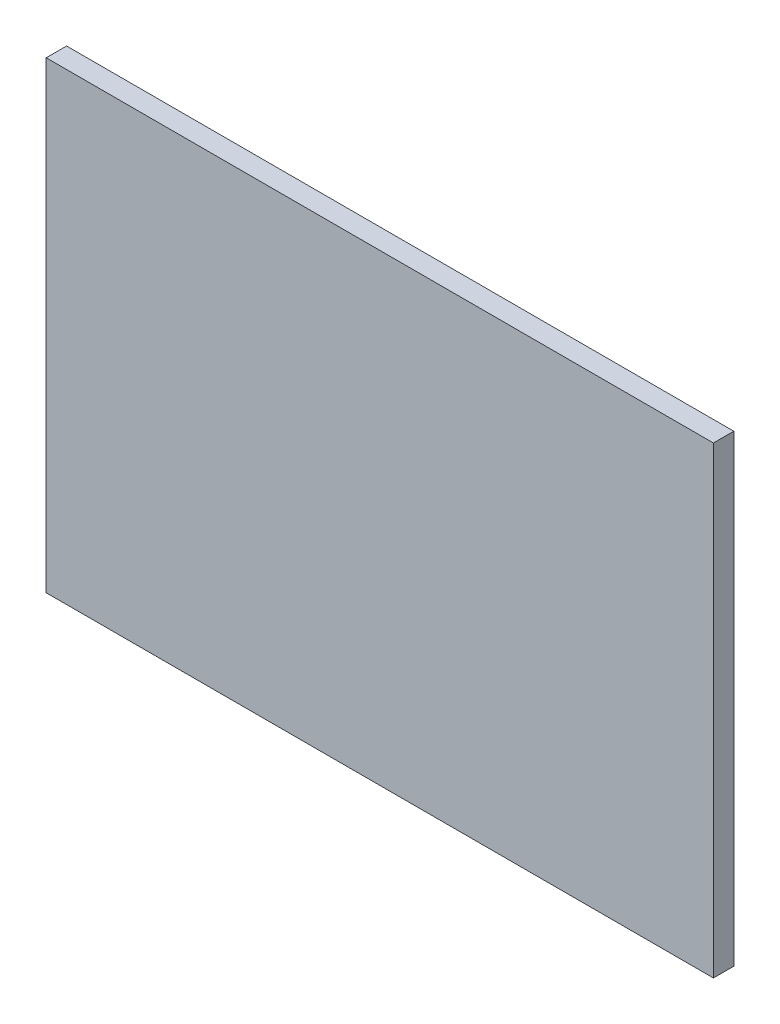
ISO-10303-21;
HEADER;
FILE_DESCRIPTION(('STEP AP214'),'2;1');
FILE_NAME('part.step','',(''),(''),'','','');
FILE_SCHEMA(('AUTOMOTIVE_DESIGN { 1 0 10303 214 1 1 1 1 }'));
ENDSEC;
DATA;
#1=APPLICATION_CONTEXT('core data for automotive mechanical design processes');
#2=APPLICATION_PROTOCOL_DEFINITION('international standard','automotive_design',2000,#1);
#3=PRODUCT_CONTEXT('',#1,'mechanical');
#4=PRODUCT('Part','Part','',(#3));
#5=PRODUCT_RELATED_PRODUCT_CATEGORY('part','',(#4));
#6=PRODUCT_DEFINITION_FORMATION('','',#4);
#7=PRODUCT_DEFINITION_CONTEXT('part definition',#1,'design');
#8=PRODUCT_DEFINITION('design','',#6,#7);
#9=PRODUCT_DEFINITION_SHAPE('','',#8);
#10=(LENGTH_UNIT() NAMED_UNIT(*) SI_UNIT(.MILLI.,.METRE.));
#11=(NAMED_UNIT(*) PLANE_ANGLE_UNIT() SI_UNIT($,.RADIAN.));
#12=(NAMED_UNIT(*) SI_UNIT($,.STERADIAN.) SOLID_ANGLE_UNIT());
#13=UNCERTAINTY_MEASURE_WITH_UNIT(LENGTH_MEASURE(1.E-05),#10,'distance_accuracy_value','');
#14=(GEOMETRIC_REPRESENTATION_CONTEXT(3) GLOBAL_UNCERTAINTY_ASSIGNED_CONTEXT((#13)) GLOBAL_UNIT_ASSIGNED_CONTEXT((#10,
#11,#12)) REPRESENTATION_CONTEXT('',''));
#15=CARTESIAN_POINT('',(0.,0.,0.));
#16=DIRECTION('',(0.,0.,1.));
#17=DIRECTION('',(1.,0.,0.));
#18=AXIS2_PLACEMENT_3D('',#15,#16,#17);
#19=CARTESIAN_POINT('',(18.,-12.5,1.1));
#20=DIRECTION('',(-1.,0.,0.));
#21=DIRECTION('',(0.,0.,1.));
#22=AXIS2_PLACEMENT_3D('',#19,#20,#21);
#23=PLANE('',#22);
#24=DIRECTION('',(0.,1.,0.));
#25=VECTOR('',#24,1.);
#26=CARTESIAN_POINT('',(18.,-12.5,0.));
#27=LINE('',#26,#25);
#28=CARTESIAN_POINT('',(18.,-12.5,0.));
#29=VERTEX_POINT('',#28);
#30=CARTESIAN_POINT('',(18.,12.5,0.));
#31=VERTEX_POINT('',#30);
#32=EDGE_CURVE('E98',#29,#31,#27,.T.);
#33=ORIENTED_EDGE('',*,*,#32,.T.);
#34=DIRECTION('',(0.,0.,-1.));
#35=VECTOR('',#34,1.);
#36=CARTESIAN_POINT('',(18.,12.5,1.1));
#37=LINE('',#36,#35);
#38=CARTESIAN_POINT('',(18.,12.5,1.1));
#39=VERTEX_POINT('',#38);
#40=EDGE_CURVE('E11',#39,#31,#37,.T.);
#41=ORIENTED_EDGE('',*,*,#40,.F.);
#42=DIRECTION('',(0.,1.,0.));
#43=VECTOR('',#42,1.);
#44=CARTESIAN_POINT('',(18.,-12.5,1.1));
#45=LINE('',#44,#43);
#46=CARTESIAN_POINT('',(18.,-12.5,1.1));
#47=VERTEX_POINT('',#46);
#48=EDGE_CURVE('E86',#47,#39,#45,.T.);
#49=ORIENTED_EDGE('',*,*,#48,.F.);
#50=DIRECTION('',(0.,0.,-1.));
#51=VECTOR('',#50,1.);
#52=CARTESIAN_POINT('',(18.,-12.5,1.1));
#53=LINE('',#52,#51);
#54=EDGE_CURVE('E94',#47,#29,#53,.T.);
#55=ORIENTED_EDGE('',*,*,#54,.T.);
#56=EDGE_LOOP('',(#33,#41,#49,#55));
#57=FACE_BOUND('',#56,.T.);
#58=ADVANCED_FACE('F35',(#57),#23,.F.);
#59=CARTESIAN_POINT('',(-18.,12.5,1.1));
#60=DIRECTION('',(0.,-1.,0.));
#61=DIRECTION('',(0.,0.,-1.));
#62=AXIS2_PLACEMENT_3D('',#59,#60,#61);
#63=PLANE('',#62);
#64=DIRECTION('',(-1.,0.,0.));
#65=VECTOR('',#64,1.);
#66=CARTESIAN_POINT('',(-18.,12.5,0.));
#67=LINE('',#66,#65);
#68=CARTESIAN_POINT('',(-18.,12.5,0.));
#69=VERTEX_POINT('',#68);
#70=EDGE_CURVE('E90',#31,#69,#67,.T.);
#71=ORIENTED_EDGE('',*,*,#70,.T.);
#72=DIRECTION('',(0.,0.,-1.));
#73=VECTOR('',#72,1.);
#74=CARTESIAN_POINT('',(-18.,12.5,1.1));
#75=LINE('',#74,#73);
#76=CARTESIAN_POINT('',(-18.,12.5,1.1));
#77=VERTEX_POINT('',#76);
#78=EDGE_CURVE('E43',#77,#69,#75,.T.);
#79=ORIENTED_EDGE('',*,*,#78,.F.);
#80=DIRECTION('',(-1.,0.,0.));
#81=VECTOR('',#80,1.);
#82=CARTESIAN_POINT('',(-18.,12.5,1.1));
#83=LINE('',#82,#81);
#84=EDGE_CURVE('E81',#39,#77,#83,.T.);
#85=ORIENTED_EDGE('',*,*,#84,.F.);
#86=ORIENTED_EDGE('',*,*,#40,.T.);
#87=EDGE_LOOP('',(#71,#79,#85,#86));
#88=FACE_BOUND('',#87,.T.);
#89=ADVANCED_FACE('F89',(#88),#63,.F.);
#90=CARTESIAN_POINT('',(-18.,-12.5,1.1));
#91=DIRECTION('',(1.,0.,0.));
#92=DIRECTION('',(0.,0.,-1.));
#93=AXIS2_PLACEMENT_3D('',#90,#91,#92);
#94=PLANE('',#93);
#95=DIRECTION('',(0.,-1.,0.));
#96=VECTOR('',#95,1.);
#97=CARTESIAN_POINT('',(-18.,-12.5,0.));
#98=LINE('',#97,#96);
#99=CARTESIAN_POINT('',(-18.,-12.5,0.));
#100=VERTEX_POINT('',#99);
#101=EDGE_CURVE('E68',#69,#100,#98,.T.);
#102=ORIENTED_EDGE('',*,*,#101,.T.);
#103=DIRECTION('',(0.,0.,-1.));
#104=VECTOR('',#103,1.);
#105=CARTESIAN_POINT('',(-18.,-12.5,1.1));
#106=LINE('',#105,#104);
#107=CARTESIAN_POINT('',(-18.,-12.5,1.1));
#108=VERTEX_POINT('',#107);
#109=EDGE_CURVE('E91',#108,#100,#106,.T.);
#110=ORIENTED_EDGE('',*,*,#109,.F.);
#111=DIRECTION('',(0.,-1.,0.));
#112=VECTOR('',#111,1.);
#113=CARTESIAN_POINT('',(-18.,-12.5,1.1));
#114=LINE('',#113,#112);
#115=EDGE_CURVE('E84',#77,#108,#114,.T.);
#116=ORIENTED_EDGE('',*,*,#115,.F.);
#117=ORIENTED_EDGE('',*,*,#78,.T.);
#118=EDGE_LOOP('',(#102,#110,#116,#117));
#119=FACE_BOUND('',#118,.T.);
#120=ADVANCED_FACE('F92',(#119),#94,.F.);
#121=CARTESIAN_POINT('',(-18.,-12.5,1.1));
#122=DIRECTION('',(0.,1.,0.));
#123=DIRECTION('',(0.,0.,1.));
#124=AXIS2_PLACEMENT_3D('',#121,#122,#123);
#125=PLANE('',#124);
#126=DIRECTION('',(1.,0.,0.));
#127=VECTOR('',#126,1.);
#128=CARTESIAN_POINT('',(-18.,-12.5,0.));
#129=LINE('',#128,#127);
#130=EDGE_CURVE('E74',#100,#29,#129,.T.);
#131=ORIENTED_EDGE('',*,*,#130,.T.);
#132=ORIENTED_EDGE('',*,*,#54,.F.);
#133=DIRECTION('',(1.,0.,0.));
#134=VECTOR('',#133,1.);
#135=CARTESIAN_POINT('',(-18.,-12.5,1.1));
#136=LINE('',#135,#134);
#137=EDGE_CURVE('E51',#108,#47,#136,.T.);
#138=ORIENTED_EDGE('',*,*,#137,.F.);
#139=ORIENTED_EDGE('',*,*,#109,.T.);
#140=EDGE_LOOP('',(#131,#132,#138,#139));
#141=FACE_BOUND('',#140,.T.);
#142=ADVANCED_FACE('F105',(#141),#125,.F.);
#143=CARTESIAN_POINT('',(0.,0.,1.1));
#144=DIRECTION('',(0.,0.,-1.));
#145=DIRECTION('',(-1.,0.,0.));
#146=AXIS2_PLACEMENT_3D('',#143,#144,#145);
#147=PLANE('',#146);
#148=ORIENTED_EDGE('',*,*,#48,.T.);
#149=ORIENTED_EDGE('',*,*,#84,.T.);
#150=ORIENTED_EDGE('',*,*,#115,.T.);
#151=ORIENTED_EDGE('',*,*,#137,.T.);
#152=EDGE_LOOP('',(#148,#149,#150,#151));
#153=FACE_BOUND('',#152,.T.);
#154=ADVANCED_FACE('F82',(#153),#147,.F.);
#155=CARTESIAN_POINT('',(0.,0.,0.));
#156=DIRECTION('',(0.,0.,-1.));
#157=DIRECTION('',(-1.,0.,0.));
#158=AXIS2_PLACEMENT_3D('',#155,#156,#157);
#159=PLANE('',#158);
#160=ORIENTED_EDGE('',*,*,#32,.F.);
#161=ORIENTED_EDGE('',*,*,#130,.F.);
#162=ORIENTED_EDGE('',*,*,#101,.F.);
#163=ORIENTED_EDGE('',*,*,#70,.F.);
#164=EDGE_LOOP('',(#160,#161,#162,#163));
#165=FACE_BOUND('',#164,.T.);
#166=ADVANCED_FACE('F108',(#165),#159,.T.);
#167=CLOSED_SHELL('',(#58,#89,#120,#142,#154,#166));
#168=MANIFOLD_SOLID_BREP('B2',#167);
#169=ADVANCED_BREP_SHAPE_REPRESENTATION('',(#18,#168),#14);
#170=SHAPE_DEFINITION_REPRESENTATION(#9,#169);
ENDSEC;
END-ISO-10303-21;
